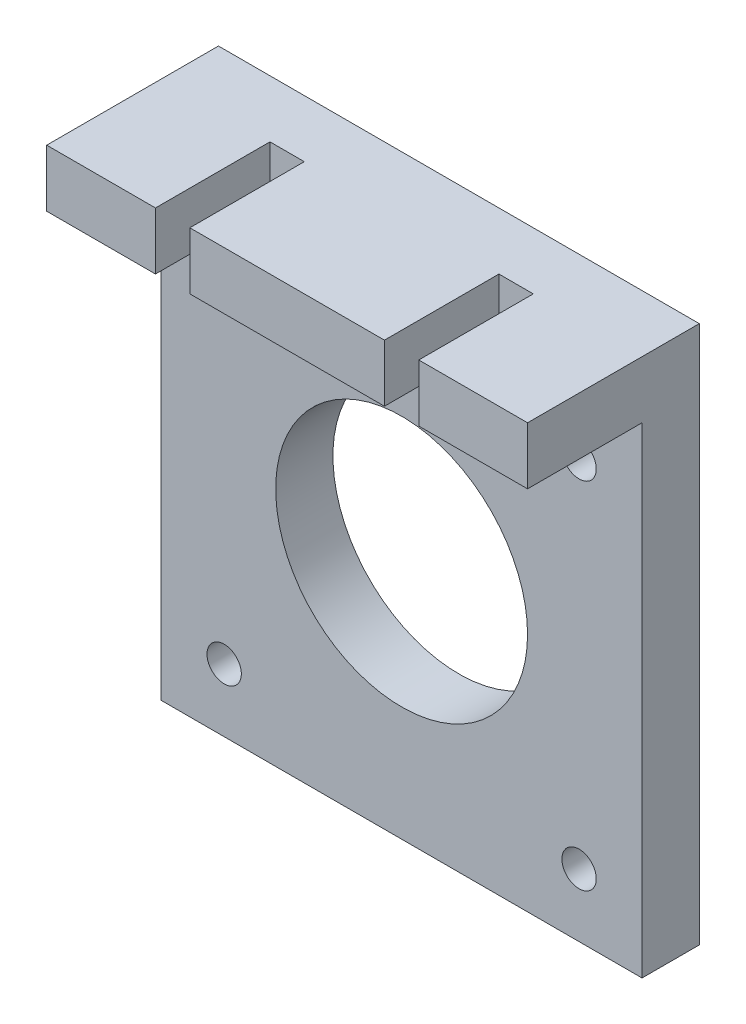
ISO-10303-21;
HEADER;
FILE_DESCRIPTION(('STEP AP214'),'2;1');
FILE_NAME('part.step','',(''),(''),'','','');
FILE_SCHEMA(('AUTOMOTIVE_DESIGN { 1 0 10303 214 1 1 1 1 }'));
ENDSEC;
DATA;
#1=APPLICATION_CONTEXT('core data for automotive mechanical design processes');
#2=APPLICATION_PROTOCOL_DEFINITION('international standard','automotive_design',2000,#1);
#3=PRODUCT_CONTEXT('',#1,'mechanical');
#4=PRODUCT('Part','Part','',(#3));
#5=PRODUCT_RELATED_PRODUCT_CATEGORY('part','',(#4));
#6=PRODUCT_DEFINITION_FORMATION('','',#4);
#7=PRODUCT_DEFINITION_CONTEXT('part definition',#1,'design');
#8=PRODUCT_DEFINITION('design','',#6,#7);
#9=PRODUCT_DEFINITION_SHAPE('','',#8);
#10=(LENGTH_UNIT() NAMED_UNIT(*) SI_UNIT(.MILLI.,.METRE.));
#11=(NAMED_UNIT(*) PLANE_ANGLE_UNIT() SI_UNIT($,.RADIAN.));
#12=(NAMED_UNIT(*) SI_UNIT($,.STERADIAN.) SOLID_ANGLE_UNIT());
#13=UNCERTAINTY_MEASURE_WITH_UNIT(LENGTH_MEASURE(1.E-05),#10,'distance_accuracy_value','');
#14=(GEOMETRIC_REPRESENTATION_CONTEXT(3) GLOBAL_UNCERTAINTY_ASSIGNED_CONTEXT((#13)) GLOBAL_UNIT_ASSIGNED_CONTEXT((#10,
#11,#12)) REPRESENTATION_CONTEXT('',''));
#15=CARTESIAN_POINT('',(0.,0.,0.));
#16=DIRECTION('',(0.,0.,1.));
#17=DIRECTION('',(1.,0.,0.));
#18=AXIS2_PLACEMENT_3D('',#15,#16,#17);
#19=CARTESIAN_POINT('',(-21.,21.,15.));
#20=DIRECTION('',(0.,1.,0.));
#21=DIRECTION('',(0.,0.,1.));
#22=AXIS2_PLACEMENT_3D('',#19,#20,#21);
#23=PLANE('',#22);
#24=DIRECTION('',(1.,0.,0.));
#25=VECTOR('',#24,1.);
#26=CARTESIAN_POINT('',(-21.,21.,5.));
#27=LINE('',#26,#25);
#28=CARTESIAN_POINT('',(-21.,21.,5.));
#29=VERTEX_POINT('',#28);
#30=CARTESIAN_POINT('',(-11.5,21.,4.99999999999999));
#31=VERTEX_POINT('',#30);
#32=EDGE_CURVE('E271',#29,#31,#27,.T.);
#33=ORIENTED_EDGE('',*,*,#32,.T.);
#34=DIRECTION('',(0.,0.,-1.));
#35=VECTOR('',#34,1.);
#36=CARTESIAN_POINT('',(-11.5,21.,4.99999999999999));
#37=LINE('',#36,#35);
#38=CARTESIAN_POINT('',(-11.5,21.,15.));
#39=VERTEX_POINT('',#38);
#40=EDGE_CURVE('E216',#39,#31,#37,.T.);
#41=ORIENTED_EDGE('',*,*,#40,.F.);
#42=DIRECTION('',(1.,0.,0.));
#43=VECTOR('',#42,1.);
#44=CARTESIAN_POINT('',(-21.,21.,15.));
#45=LINE('',#44,#43);
#46=CARTESIAN_POINT('',(-21.,21.,15.));
#47=VERTEX_POINT('',#46);
#48=EDGE_CURVE('E272',#47,#39,#45,.T.);
#49=ORIENTED_EDGE('',*,*,#48,.F.);
#50=DIRECTION('',(0.,0.,-1.));
#51=VECTOR('',#50,1.);
#52=CARTESIAN_POINT('',(-21.,21.,15.));
#53=LINE('',#52,#51);
#54=EDGE_CURVE('E288',#47,#29,#53,.T.);
#55=ORIENTED_EDGE('',*,*,#54,.T.);
#56=EDGE_LOOP('',(#33,#41,#49,#55));
#57=FACE_BOUND('',#56,.T.);
#58=ADVANCED_FACE('F108',(#57),#23,.F.);
#59=CARTESIAN_POINT('',(-8.5,21.,15.));
#60=VERTEX_POINT('',#59);
#61=CARTESIAN_POINT('',(8.5,21.,15.));
#62=VERTEX_POINT('',#61);
#63=EDGE_CURVE('E276',#60,#62,#45,.T.);
#64=ORIENTED_EDGE('',*,*,#63,.F.);
#65=DIRECTION('',(0.,0.,1.));
#66=VECTOR('',#65,1.);
#67=CARTESIAN_POINT('',(-8.5,21.,4.99999999999999));
#68=LINE('',#67,#66);
#69=CARTESIAN_POINT('',(-8.5,21.,4.99999999999999));
#70=VERTEX_POINT('',#69);
#71=EDGE_CURVE('E133',#70,#60,#68,.T.);
#72=ORIENTED_EDGE('',*,*,#71,.F.);
#73=CARTESIAN_POINT('',(8.5,21.,5.));
#74=VERTEX_POINT('',#73);
#75=EDGE_CURVE('E285',#70,#74,#27,.T.);
#76=ORIENTED_EDGE('',*,*,#75,.T.);
#77=DIRECTION('',(0.,0.,-1.));
#78=VECTOR('',#77,1.);
#79=CARTESIAN_POINT('',(8.5,21.,5.));
#80=LINE('',#79,#78);
#81=EDGE_CURVE('E257',#62,#74,#80,.T.);
#82=ORIENTED_EDGE('',*,*,#81,.F.);
#83=EDGE_LOOP('',(#64,#72,#76,#82));
#84=FACE_BOUND('',#83,.T.);
#85=ADVANCED_FACE('F378',(#84),#23,.F.);
#86=CARTESIAN_POINT('',(0.,0.,15.));
#87=DIRECTION('',(0.,0.,1.));
#88=DIRECTION('',(1.,0.,0.));
#89=AXIS2_PLACEMENT_3D('',#86,#87,#88);
#90=PLANE('',#89);
#91=DIRECTION('',(0.,-1.,0.));
#92=VECTOR('',#91,1.);
#93=CARTESIAN_POINT('',(-11.5,26.,15.));
#94=LINE('',#93,#92);
#95=CARTESIAN_POINT('',(-11.5,26.,15.));
#96=VERTEX_POINT('',#95);
#97=EDGE_CURVE('E241',#96,#39,#94,.T.);
#98=ORIENTED_EDGE('',*,*,#97,.F.);
#99=DIRECTION('',(-1.,0.,0.));
#100=VECTOR('',#99,1.);
#101=CARTESIAN_POINT('',(-21.,26.,15.));
#102=LINE('',#101,#100);
#103=CARTESIAN_POINT('',(-21.,26.,15.));
#104=VERTEX_POINT('',#103);
#105=EDGE_CURVE('E234',#96,#104,#102,.T.);
#106=ORIENTED_EDGE('',*,*,#105,.T.);
#107=DIRECTION('',(0.,-1.,0.));
#108=VECTOR('',#107,1.);
#109=CARTESIAN_POINT('',(-21.,26.,15.));
#110=LINE('',#109,#108);
#111=EDGE_CURVE('E267',#104,#47,#110,.T.);
#112=ORIENTED_EDGE('',*,*,#111,.T.);
#113=ORIENTED_EDGE('',*,*,#48,.T.);
#114=EDGE_LOOP('',(#98,#106,#112,#113));
#115=FACE_BOUND('',#114,.T.);
#116=ADVANCED_FACE('F383',(#115),#90,.T.);
#117=DIRECTION('',(0.,-1.,0.));
#118=VECTOR('',#117,1.);
#119=CARTESIAN_POINT('',(-8.5,26.,15.));
#120=LINE('',#119,#118);
#121=CARTESIAN_POINT('',(-8.5,26.,15.));
#122=VERTEX_POINT('',#121);
#123=EDGE_CURVE('E244',#122,#60,#120,.T.);
#124=ORIENTED_EDGE('',*,*,#123,.T.);
#125=ORIENTED_EDGE('',*,*,#63,.T.);
#126=DIRECTION('',(0.,-1.,0.));
#127=VECTOR('',#126,1.);
#128=CARTESIAN_POINT('',(8.5,26.,15.));
#129=LINE('',#128,#127);
#130=CARTESIAN_POINT('',(8.5,26.,15.));
#131=VERTEX_POINT('',#130);
#132=EDGE_CURVE('E239',#131,#62,#129,.T.);
#133=ORIENTED_EDGE('',*,*,#132,.F.);
#134=EDGE_CURVE('E283',#131,#122,#102,.T.);
#135=ORIENTED_EDGE('',*,*,#134,.T.);
#136=EDGE_LOOP('',(#124,#125,#133,#135));
#137=FACE_BOUND('',#136,.T.);
#138=ADVANCED_FACE('F373',(#137),#90,.T.);
#139=CARTESIAN_POINT('',(-21.,26.,5.));
#140=DIRECTION('',(0.,1.,0.));
#141=DIRECTION('',(0.,0.,1.));
#142=AXIS2_PLACEMENT_3D('',#139,#140,#141);
#143=PLANE('',#142);
#144=DIRECTION('',(0.,0.,-1.));
#145=VECTOR('',#144,1.);
#146=CARTESIAN_POINT('',(-11.5,26.,4.99999999999999));
#147=LINE('',#146,#145);
#148=CARTESIAN_POINT('',(-11.5,26.,4.99999999999999));
#149=VERTEX_POINT('',#148);
#150=EDGE_CURVE('E213',#96,#149,#147,.T.);
#151=ORIENTED_EDGE('',*,*,#150,.T.);
#152=DIRECTION('',(1.,0.,0.));
#153=VECTOR('',#152,1.);
#154=CARTESIAN_POINT('',(-11.5,26.,4.99999999999999));
#155=LINE('',#154,#153);
#156=CARTESIAN_POINT('',(-8.5,26.,4.99999999999999));
#157=VERTEX_POINT('',#156);
#158=EDGE_CURVE('E223',#149,#157,#155,.T.);
#159=ORIENTED_EDGE('',*,*,#158,.T.);
#160=DIRECTION('',(0.,0.,1.));
#161=VECTOR('',#160,1.);
#162=CARTESIAN_POINT('',(-8.5,26.,4.99999999999999));
#163=LINE('',#162,#161);
#164=EDGE_CURVE('E220',#157,#122,#163,.T.);
#165=ORIENTED_EDGE('',*,*,#164,.T.);
#166=ORIENTED_EDGE('',*,*,#134,.F.);
#167=DIRECTION('',(0.,0.,-1.));
#168=VECTOR('',#167,1.);
#169=CARTESIAN_POINT('',(8.5,26.,5.));
#170=LINE('',#169,#168);
#171=CARTESIAN_POINT('',(8.5,26.,5.));
#172=VERTEX_POINT('',#171);
#173=EDGE_CURVE('E247',#131,#172,#170,.T.);
#174=ORIENTED_EDGE('',*,*,#173,.T.);
#175=DIRECTION('',(1.,0.,0.));
#176=VECTOR('',#175,1.);
#177=CARTESIAN_POINT('',(8.5,26.,5.));
#178=LINE('',#177,#176);
#179=CARTESIAN_POINT('',(11.5,26.,5.));
#180=VERTEX_POINT('',#179);
#181=EDGE_CURVE('E250',#172,#180,#178,.T.);
#182=ORIENTED_EDGE('',*,*,#181,.T.);
#183=DIRECTION('',(0.,0.,1.));
#184=VECTOR('',#183,1.);
#185=CARTESIAN_POINT('',(11.5,26.,5.));
#186=LINE('',#185,#184);
#187=CARTESIAN_POINT('',(11.5,26.,15.));
#188=VERTEX_POINT('',#187);
#189=EDGE_CURVE('E253',#180,#188,#186,.T.);
#190=ORIENTED_EDGE('',*,*,#189,.T.);
#191=CARTESIAN_POINT('',(21.,26.,15.));
#192=VERTEX_POINT('',#191);
#193=EDGE_CURVE('E279',#192,#188,#102,.T.);
#194=ORIENTED_EDGE('',*,*,#193,.F.);
#195=DIRECTION('',(0.,0.,-1.));
#196=VECTOR('',#195,1.);
#197=CARTESIAN_POINT('',(21.,26.,5.));
#198=LINE('',#197,#196);
#199=CARTESIAN_POINT('',(21.,26.,0.));
#200=VERTEX_POINT('',#199);
#201=EDGE_CURVE('E117',#192,#200,#198,.T.);
#202=ORIENTED_EDGE('',*,*,#201,.T.);
#203=DIRECTION('',(1.,0.,0.));
#204=VECTOR('',#203,1.);
#205=CARTESIAN_POINT('',(-21.,26.,0.));
#206=LINE('',#205,#204);
#207=CARTESIAN_POINT('',(-21.,26.,0.));
#208=VERTEX_POINT('',#207);
#209=EDGE_CURVE('E299',#208,#200,#206,.T.);
#210=ORIENTED_EDGE('',*,*,#209,.F.);
#211=DIRECTION('',(0.,0.,-1.));
#212=VECTOR('',#211,1.);
#213=CARTESIAN_POINT('',(-21.,26.,5.));
#214=LINE('',#213,#212);
#215=EDGE_CURVE('E12',#104,#208,#214,.T.);
#216=ORIENTED_EDGE('',*,*,#215,.F.);
#217=ORIENTED_EDGE('',*,*,#105,.F.);
#218=EDGE_LOOP('',(#151,#159,#165,#166,#174,#182,#190,#194,#202,#210,#216,#217));
#219=FACE_BOUND('',#218,.T.);
#220=ADVANCED_FACE('F232',(#219),#143,.T.);
#221=CARTESIAN_POINT('',(-21.,21.,5.));
#222=DIRECTION('',(-1.,0.,0.));
#223=DIRECTION('',(0.,0.,1.));
#224=AXIS2_PLACEMENT_3D('',#221,#222,#223);
#225=PLANE('',#224);
#226=DIRECTION('',(0.,1.,0.));
#227=VECTOR('',#226,1.);
#228=CARTESIAN_POINT('',(-21.,21.,0.));
#229=LINE('',#228,#227);
#230=CARTESIAN_POINT('',(-21.,-21.,0.));
#231=VERTEX_POINT('',#230);
#232=EDGE_CURVE('E296',#231,#208,#229,.T.);
#233=ORIENTED_EDGE('',*,*,#232,.F.);
#234=DIRECTION('',(0.,0.,-1.));
#235=VECTOR('',#234,1.);
#236=CARTESIAN_POINT('',(-21.,-21.,5.));
#237=LINE('',#236,#235);
#238=CARTESIAN_POINT('',(-21.,-21.,5.));
#239=VERTEX_POINT('',#238);
#240=EDGE_CURVE('E112',#239,#231,#237,.T.);
#241=ORIENTED_EDGE('',*,*,#240,.F.);
#242=DIRECTION('',(0.,1.,0.));
#243=VECTOR('',#242,1.);
#244=CARTESIAN_POINT('',(-21.,21.,5.));
#245=LINE('',#244,#243);
#246=EDGE_CURVE('E295',#239,#29,#245,.T.);
#247=ORIENTED_EDGE('',*,*,#246,.T.);
#248=ORIENTED_EDGE('',*,*,#54,.F.);
#249=ORIENTED_EDGE('',*,*,#111,.F.);
#250=ORIENTED_EDGE('',*,*,#215,.T.);
#251=EDGE_LOOP('',(#233,#241,#247,#248,#249,#250));
#252=FACE_BOUND('',#251,.T.);
#253=ADVANCED_FACE('F386',(#252),#225,.T.);
#254=CARTESIAN_POINT('',(21.,21.,5.));
#255=DIRECTION('',(-1.,0.,0.));
#256=DIRECTION('',(0.,0.,1.));
#257=AXIS2_PLACEMENT_3D('',#254,#255,#256);
#258=PLANE('',#257);
#259=DIRECTION('',(0.,1.,0.));
#260=VECTOR('',#259,1.);
#261=CARTESIAN_POINT('',(21.,21.,0.));
#262=LINE('',#261,#260);
#263=CARTESIAN_POINT('',(21.,-21.,0.));
#264=VERTEX_POINT('',#263);
#265=EDGE_CURVE('E302',#264,#200,#262,.T.);
#266=ORIENTED_EDGE('',*,*,#265,.T.);
#267=ORIENTED_EDGE('',*,*,#201,.F.);
#268=DIRECTION('',(0.,1.,0.));
#269=VECTOR('',#268,1.);
#270=CARTESIAN_POINT('',(21.,26.,15.));
#271=LINE('',#270,#269);
#272=CARTESIAN_POINT('',(21.,21.,15.));
#273=VERTEX_POINT('',#272);
#274=EDGE_CURVE('E275',#273,#192,#271,.T.);
#275=ORIENTED_EDGE('',*,*,#274,.F.);
#276=DIRECTION('',(0.,0.,-1.));
#277=VECTOR('',#276,1.);
#278=CARTESIAN_POINT('',(21.,21.,15.));
#279=LINE('',#278,#277);
#280=CARTESIAN_POINT('',(21.,21.,5.));
#281=VERTEX_POINT('',#280);
#282=EDGE_CURVE('E282',#273,#281,#279,.T.);
#283=ORIENTED_EDGE('',*,*,#282,.T.);
#284=DIRECTION('',(0.,1.,0.));
#285=VECTOR('',#284,1.);
#286=CARTESIAN_POINT('',(21.,21.,5.));
#287=LINE('',#286,#285);
#288=CARTESIAN_POINT('',(21.,-21.,5.));
#289=VERTEX_POINT('',#288);
#290=EDGE_CURVE('E292',#289,#281,#287,.T.);
#291=ORIENTED_EDGE('',*,*,#290,.F.);
#292=DIRECTION('',(0.,0.,-1.));
#293=VECTOR('',#292,1.);
#294=CARTESIAN_POINT('',(21.,-21.,5.));
#295=LINE('',#294,#293);
#296=EDGE_CURVE('E341',#289,#264,#295,.T.);
#297=ORIENTED_EDGE('',*,*,#296,.T.);
#298=EDGE_LOOP('',(#266,#267,#275,#283,#291,#297));
#299=FACE_BOUND('',#298,.T.);
#300=ADVANCED_FACE('F356',(#299),#258,.F.);
#301=CARTESIAN_POINT('',(0.,0.,5.));
#302=DIRECTION('',(0.,0.,1.));
#303=DIRECTION('',(1.,0.,0.));
#304=AXIS2_PLACEMENT_3D('',#301,#302,#303);
#305=PLANE('',#304);
#306=ORIENTED_EDGE('',*,*,#32,.F.);
#307=ORIENTED_EDGE('',*,*,#246,.F.);
#308=DIRECTION('',(-1.,0.,0.));
#309=VECTOR('',#308,1.);
#310=CARTESIAN_POINT('',(21.,-21.,5.));
#311=LINE('',#310,#309);
#312=EDGE_CURVE('E338',#289,#239,#311,.T.);
#313=ORIENTED_EDGE('',*,*,#312,.F.);
#314=ORIENTED_EDGE('',*,*,#290,.T.);
#315=CARTESIAN_POINT('',(11.5,21.,5.));
#316=VERTEX_POINT('',#315);
#317=EDGE_CURVE('E243',#316,#281,#27,.T.);
#318=ORIENTED_EDGE('',*,*,#317,.F.);
#319=DIRECTION('',(0.,-1.,0.));
#320=VECTOR('',#319,1.);
#321=CARTESIAN_POINT('',(11.5,26.,5.));
#322=LINE('',#321,#320);
#323=EDGE_CURVE('E264',#180,#316,#322,.T.);
#324=ORIENTED_EDGE('',*,*,#323,.F.);
#325=ORIENTED_EDGE('',*,*,#181,.F.);
#326=DIRECTION('',(0.,-1.,0.));
#327=VECTOR('',#326,1.);
#328=CARTESIAN_POINT('',(8.5,26.,5.));
#329=LINE('',#328,#327);
#330=EDGE_CURVE('E256',#172,#74,#329,.T.);
#331=ORIENTED_EDGE('',*,*,#330,.T.);
#332=ORIENTED_EDGE('',*,*,#75,.F.);
#333=DIRECTION('',(0.,-1.,0.));
#334=VECTOR('',#333,1.);
#335=CARTESIAN_POINT('',(-8.5,26.,4.99999999999999));
#336=LINE('',#335,#334);
#337=EDGE_CURVE('E219',#157,#70,#336,.T.);
#338=ORIENTED_EDGE('',*,*,#337,.F.);
#339=ORIENTED_EDGE('',*,*,#158,.F.);
#340=DIRECTION('',(0.,-1.,0.));
#341=VECTOR('',#340,1.);
#342=CARTESIAN_POINT('',(-11.5,26.,4.99999999999999));
#343=LINE('',#342,#341);
#344=EDGE_CURVE('E209',#149,#31,#343,.T.);
#345=ORIENTED_EDGE('',*,*,#344,.T.);
#346=EDGE_LOOP('',(#306,#307,#313,#314,#318,#324,#325,#331,#332,#338,#339,#345));
#347=FACE_BOUND('',#346,.T.);
#348=CARTESIAN_POINT('',(-15.5,-15.5,5.));
#349=DIRECTION('',(0.,0.,-1.));
#350=DIRECTION('',(-1.,0.,0.));
#351=AXIS2_PLACEMENT_3D('',#348,#349,#350);
#352=CIRCLE('',#351,1.5);
#353=CARTESIAN_POINT('',(-17.,-15.5,5.));
#354=VERTEX_POINT('',#353);
#355=EDGE_CURVE('E314',#354,#354,#352,.T.);
#356=ORIENTED_EDGE('',*,*,#355,.T.);
#357=EDGE_LOOP('',(#356));
#358=FACE_BOUND('',#357,.T.);
#359=CARTESIAN_POINT('',(15.5,15.5,5.));
#360=DIRECTION('',(0.,0.,1.));
#361=DIRECTION('',(1.,0.,0.));
#362=AXIS2_PLACEMENT_3D('',#359,#360,#361);
#363=CIRCLE('',#362,1.5);
#364=CARTESIAN_POINT('',(17.,15.5,5.));
#365=VERTEX_POINT('',#364);
#366=EDGE_CURVE('E326',#365,#365,#363,.F.);
#367=ORIENTED_EDGE('',*,*,#366,.T.);
#368=EDGE_LOOP('',(#367));
#369=FACE_BOUND('',#368,.T.);
#370=CARTESIAN_POINT('',(-15.5,15.5,5.));
#371=DIRECTION('',(0.,0.,1.));
#372=DIRECTION('',(1.,0.,0.));
#373=AXIS2_PLACEMENT_3D('',#370,#371,#372);
#374=CIRCLE('',#373,1.5);
#375=CARTESIAN_POINT('',(-14.,15.5,5.));
#376=VERTEX_POINT('',#375);
#377=EDGE_CURVE('E332',#376,#376,#374,.T.);
#378=ORIENTED_EDGE('',*,*,#377,.F.);
#379=EDGE_LOOP('',(#378));
#380=FACE_BOUND('',#379,.T.);
#381=CARTESIAN_POINT('',(15.5,-15.5,5.));
#382=DIRECTION('',(0.,0.,1.));
#383=DIRECTION('',(1.,0.,0.));
#384=AXIS2_PLACEMENT_3D('',#381,#382,#383);
#385=CIRCLE('',#384,1.5);
#386=CARTESIAN_POINT('',(17.,-15.5,5.));
#387=VERTEX_POINT('',#386);
#388=EDGE_CURVE('E320',#387,#387,#385,.T.);
#389=ORIENTED_EDGE('',*,*,#388,.F.);
#390=EDGE_LOOP('',(#389));
#391=FACE_BOUND('',#390,.T.);
#392=CARTESIAN_POINT('',(0.,0.,5.));
#393=DIRECTION('',(0.,0.,1.));
#394=DIRECTION('',(1.,0.,0.));
#395=AXIS2_PLACEMENT_3D('',#392,#393,#394);
#396=CIRCLE('',#395,11.);
#397=CARTESIAN_POINT('',(11.,0.,5.));
#398=VERTEX_POINT('',#397);
#399=EDGE_CURVE('E308',#398,#398,#396,.T.);
#400=ORIENTED_EDGE('',*,*,#399,.F.);
#401=EDGE_LOOP('',(#400));
#402=FACE_BOUND('',#401,.T.);
#403=ADVANCED_FACE('F224',(#347,#358,#369,#380,#391,#402),#305,.T.);
#404=CARTESIAN_POINT('',(0.,0.,0.));
#405=DIRECTION('',(0.,0.,1.));
#406=DIRECTION('',(1.,0.,0.));
#407=AXIS2_PLACEMENT_3D('',#404,#405,#406);
#408=PLANE('',#407);
#409=ORIENTED_EDGE('',*,*,#209,.T.);
#410=ORIENTED_EDGE('',*,*,#265,.F.);
#411=DIRECTION('',(-1.,0.,0.));
#412=VECTOR('',#411,1.);
#413=CARTESIAN_POINT('',(21.,-21.,0.));
#414=LINE('',#413,#412);
#415=EDGE_CURVE('E335',#264,#231,#414,.T.);
#416=ORIENTED_EDGE('',*,*,#415,.T.);
#417=ORIENTED_EDGE('',*,*,#232,.T.);
#418=EDGE_LOOP('',(#409,#410,#416,#417));
#419=FACE_BOUND('',#418,.T.);
#420=CARTESIAN_POINT('',(15.5,-15.5,0.));
#421=DIRECTION('',(0.,0.,1.));
#422=DIRECTION('',(1.,0.,0.));
#423=AXIS2_PLACEMENT_3D('',#420,#421,#422);
#424=CIRCLE('',#423,1.5);
#425=CARTESIAN_POINT('',(17.,-15.5,0.));
#426=VERTEX_POINT('',#425);
#427=EDGE_CURVE('E317',#426,#426,#424,.T.);
#428=ORIENTED_EDGE('',*,*,#427,.T.);
#429=EDGE_LOOP('',(#428));
#430=FACE_BOUND('',#429,.T.);
#431=CARTESIAN_POINT('',(15.5,15.5,0.));
#432=DIRECTION('',(0.,0.,1.));
#433=DIRECTION('',(1.,0.,0.));
#434=AXIS2_PLACEMENT_3D('',#431,#432,#433);
#435=CIRCLE('',#434,1.5);
#436=CARTESIAN_POINT('',(17.,15.5,0.));
#437=VERTEX_POINT('',#436);
#438=EDGE_CURVE('E323',#437,#437,#435,.F.);
#439=ORIENTED_EDGE('',*,*,#438,.F.);
#440=EDGE_LOOP('',(#439));
#441=FACE_BOUND('',#440,.T.);
#442=CARTESIAN_POINT('',(-15.5,15.5,0.));
#443=DIRECTION('',(0.,0.,1.));
#444=DIRECTION('',(1.,0.,0.));
#445=AXIS2_PLACEMENT_3D('',#442,#443,#444);
#446=CIRCLE('',#445,1.5);
#447=CARTESIAN_POINT('',(-14.,15.5,0.));
#448=VERTEX_POINT('',#447);
#449=EDGE_CURVE('E329',#448,#448,#446,.T.);
#450=ORIENTED_EDGE('',*,*,#449,.T.);
#451=EDGE_LOOP('',(#450));
#452=FACE_BOUND('',#451,.T.);
#453=CARTESIAN_POINT('',(-15.5,-15.5,0.));
#454=DIRECTION('',(0.,0.,-1.));
#455=DIRECTION('',(-1.,0.,0.));
#456=AXIS2_PLACEMENT_3D('',#453,#454,#455);
#457=CIRCLE('',#456,1.5);
#458=CARTESIAN_POINT('',(-17.,-15.5,0.));
#459=VERTEX_POINT('',#458);
#460=EDGE_CURVE('E311',#459,#459,#457,.T.);
#461=ORIENTED_EDGE('',*,*,#460,.F.);
#462=EDGE_LOOP('',(#461));
#463=FACE_BOUND('',#462,.T.);
#464=CARTESIAN_POINT('',(0.,0.,0.));
#465=DIRECTION('',(0.,0.,1.));
#466=DIRECTION('',(1.,0.,0.));
#467=AXIS2_PLACEMENT_3D('',#464,#465,#466);
#468=CIRCLE('',#467,11.);
#469=CARTESIAN_POINT('',(11.,0.,0.));
#470=VERTEX_POINT('',#469);
#471=EDGE_CURVE('E291',#470,#470,#468,.T.);
#472=ORIENTED_EDGE('',*,*,#471,.T.);
#473=EDGE_LOOP('',(#472));
#474=FACE_BOUND('',#473,.T.);
#475=ADVANCED_FACE('F353',(#419,#430,#441,#452,#463,#474),#408,.F.);
#476=CARTESIAN_POINT('',(0.,0.,5.));
#477=DIRECTION('',(0.,0.,-1.));
#478=DIRECTION('',(-1.,0.,0.));
#479=AXIS2_PLACEMENT_3D('',#476,#477,#478);
#480=CYLINDRICAL_SURFACE('',#479,11.);
#481=ORIENTED_EDGE('',*,*,#399,.T.);
#482=EDGE_LOOP('',(#481));
#483=FACE_BOUND('',#482,.T.);
#484=ORIENTED_EDGE('',*,*,#471,.F.);
#485=EDGE_LOOP('',(#484));
#486=FACE_BOUND('',#485,.T.);
#487=ADVANCED_FACE('F403',(#483,#486),#480,.F.);
#488=CARTESIAN_POINT('',(15.5,-15.5,5.));
#489=DIRECTION('',(0.,0.,-1.));
#490=DIRECTION('',(-1.,0.,0.));
#491=AXIS2_PLACEMENT_3D('',#488,#489,#490);
#492=CYLINDRICAL_SURFACE('',#491,1.5);
#493=ORIENTED_EDGE('',*,*,#388,.T.);
#494=EDGE_LOOP('',(#493));
#495=FACE_BOUND('',#494,.T.);
#496=ORIENTED_EDGE('',*,*,#427,.F.);
#497=EDGE_LOOP('',(#496));
#498=FACE_BOUND('',#497,.T.);
#499=ADVANCED_FACE('F409',(#495,#498),#492,.F.);
#500=CARTESIAN_POINT('',(-15.5,15.5,5.));
#501=DIRECTION('',(0.,0.,-1.));
#502=DIRECTION('',(-1.,0.,0.));
#503=AXIS2_PLACEMENT_3D('',#500,#501,#502);
#504=CYLINDRICAL_SURFACE('',#503,1.5);
#505=ORIENTED_EDGE('',*,*,#377,.T.);
#506=EDGE_LOOP('',(#505));
#507=FACE_BOUND('',#506,.T.);
#508=ORIENTED_EDGE('',*,*,#449,.F.);
#509=EDGE_LOOP('',(#508));
#510=FACE_BOUND('',#509,.T.);
#511=ADVANCED_FACE('F401',(#507,#510),#504,.F.);
#512=CARTESIAN_POINT('',(15.5,15.5,5.));
#513=DIRECTION('',(0.,0.,-1.));
#514=DIRECTION('',(-1.,0.,0.));
#515=AXIS2_PLACEMENT_3D('',#512,#513,#514);
#516=CYLINDRICAL_SURFACE('',#515,1.5);
#517=ORIENTED_EDGE('',*,*,#366,.F.);
#518=EDGE_LOOP('',(#517));
#519=FACE_BOUND('',#518,.T.);
#520=ORIENTED_EDGE('',*,*,#438,.T.);
#521=EDGE_LOOP('',(#520));
#522=FACE_BOUND('',#521,.T.);
#523=ADVANCED_FACE('F421',(#519,#522),#516,.F.);
#524=CARTESIAN_POINT('',(-15.5,-15.5,5.));
#525=DIRECTION('',(0.,0.,-1.));
#526=DIRECTION('',(-1.,0.,0.));
#527=AXIS2_PLACEMENT_3D('',#524,#525,#526);
#528=CYLINDRICAL_SURFACE('',#527,1.5);
#529=ORIENTED_EDGE('',*,*,#355,.F.);
#530=EDGE_LOOP('',(#529));
#531=FACE_BOUND('',#530,.T.);
#532=ORIENTED_EDGE('',*,*,#460,.T.);
#533=EDGE_LOOP('',(#532));
#534=FACE_BOUND('',#533,.T.);
#535=ADVANCED_FACE('F400',(#531,#534),#528,.F.);
#536=CARTESIAN_POINT('',(21.,-21.,5.));
#537=DIRECTION('',(0.,-1.,0.));
#538=DIRECTION('',(0.,0.,-1.));
#539=AXIS2_PLACEMENT_3D('',#536,#537,#538);
#540=PLANE('',#539);
#541=ORIENTED_EDGE('',*,*,#415,.F.);
#542=ORIENTED_EDGE('',*,*,#296,.F.);
#543=ORIENTED_EDGE('',*,*,#312,.T.);
#544=ORIENTED_EDGE('',*,*,#240,.T.);
#545=EDGE_LOOP('',(#541,#542,#543,#544));
#546=FACE_BOUND('',#545,.T.);
#547=ADVANCED_FACE('F110',(#546),#540,.T.);
#548=CARTESIAN_POINT('',(11.5,21.,15.));
#549=VERTEX_POINT('',#548);
#550=EDGE_CURVE('E270',#549,#273,#45,.T.);
#551=ORIENTED_EDGE('',*,*,#550,.F.);
#552=DIRECTION('',(0.,0.,1.));
#553=VECTOR('',#552,1.);
#554=CARTESIAN_POINT('',(11.5,21.,5.));
#555=LINE('',#554,#553);
#556=EDGE_CURVE('E125',#316,#549,#555,.T.);
#557=ORIENTED_EDGE('',*,*,#556,.F.);
#558=ORIENTED_EDGE('',*,*,#317,.T.);
#559=ORIENTED_EDGE('',*,*,#282,.F.);
#560=EDGE_LOOP('',(#551,#557,#558,#559));
#561=FACE_BOUND('',#560,.T.);
#562=ADVANCED_FACE('F367',(#561),#23,.F.);
#563=DIRECTION('',(0.,-1.,0.));
#564=VECTOR('',#563,1.);
#565=CARTESIAN_POINT('',(11.5,26.,15.));
#566=LINE('',#565,#564);
#567=EDGE_CURVE('E262',#188,#549,#566,.T.);
#568=ORIENTED_EDGE('',*,*,#567,.T.);
#569=ORIENTED_EDGE('',*,*,#550,.T.);
#570=ORIENTED_EDGE('',*,*,#274,.T.);
#571=ORIENTED_EDGE('',*,*,#193,.T.);
#572=EDGE_LOOP('',(#568,#569,#570,#571));
#573=FACE_BOUND('',#572,.T.);
#574=ADVANCED_FACE('F360',(#573),#90,.T.);
#575=CARTESIAN_POINT('',(8.5,26.,5.));
#576=DIRECTION('',(-1.,0.,0.));
#577=DIRECTION('',(0.,0.,1.));
#578=AXIS2_PLACEMENT_3D('',#575,#576,#577);
#579=PLANE('',#578);
#580=ORIENTED_EDGE('',*,*,#81,.T.);
#581=ORIENTED_EDGE('',*,*,#330,.F.);
#582=ORIENTED_EDGE('',*,*,#173,.F.);
#583=ORIENTED_EDGE('',*,*,#132,.T.);
#584=EDGE_LOOP('',(#580,#581,#582,#583));
#585=FACE_BOUND('',#584,.T.);
#586=ADVANCED_FACE('F381',(#585),#579,.F.);
#587=CARTESIAN_POINT('',(11.5,26.,5.));
#588=DIRECTION('',(1.,0.,0.));
#589=DIRECTION('',(0.,0.,-1.));
#590=AXIS2_PLACEMENT_3D('',#587,#588,#589);
#591=PLANE('',#590);
#592=ORIENTED_EDGE('',*,*,#556,.T.);
#593=ORIENTED_EDGE('',*,*,#567,.F.);
#594=ORIENTED_EDGE('',*,*,#189,.F.);
#595=ORIENTED_EDGE('',*,*,#323,.T.);
#596=EDGE_LOOP('',(#592,#593,#594,#595));
#597=FACE_BOUND('',#596,.T.);
#598=ADVANCED_FACE('F365',(#597),#591,.F.);
#599=CARTESIAN_POINT('',(-11.5,26.,4.99999999999999));
#600=DIRECTION('',(-1.,0.,0.));
#601=DIRECTION('',(0.,0.,1.));
#602=AXIS2_PLACEMENT_3D('',#599,#600,#601);
#603=PLANE('',#602);
#604=ORIENTED_EDGE('',*,*,#40,.T.);
#605=ORIENTED_EDGE('',*,*,#344,.F.);
#606=ORIENTED_EDGE('',*,*,#150,.F.);
#607=ORIENTED_EDGE('',*,*,#97,.T.);
#608=EDGE_LOOP('',(#604,#605,#606,#607));
#609=FACE_BOUND('',#608,.T.);
#610=ADVANCED_FACE('F211',(#609),#603,.F.);
#611=CARTESIAN_POINT('',(-8.5,26.,4.99999999999999));
#612=DIRECTION('',(1.,0.,0.));
#613=DIRECTION('',(0.,0.,-1.));
#614=AXIS2_PLACEMENT_3D('',#611,#612,#613);
#615=PLANE('',#614);
#616=ORIENTED_EDGE('',*,*,#71,.T.);
#617=ORIENTED_EDGE('',*,*,#123,.F.);
#618=ORIENTED_EDGE('',*,*,#164,.F.);
#619=ORIENTED_EDGE('',*,*,#337,.T.);
#620=EDGE_LOOP('',(#616,#617,#618,#619));
#621=FACE_BOUND('',#620,.T.);
#622=ADVANCED_FACE('F553',(#621),#615,.F.);
#623=CLOSED_SHELL('',(#58,#85,#116,#138,#220,#253,#300,#403,#475,#487,#499,#511,#523,#535,#547,
#562,#574,#586,#598,#610,#622));
#624=MANIFOLD_SOLID_BREP('B2',#623);
#625=ADVANCED_BREP_SHAPE_REPRESENTATION('',(#18,#624),#14);
#626=SHAPE_DEFINITION_REPRESENTATION(#9,#625);
ENDSEC;
END-ISO-10303-21;
